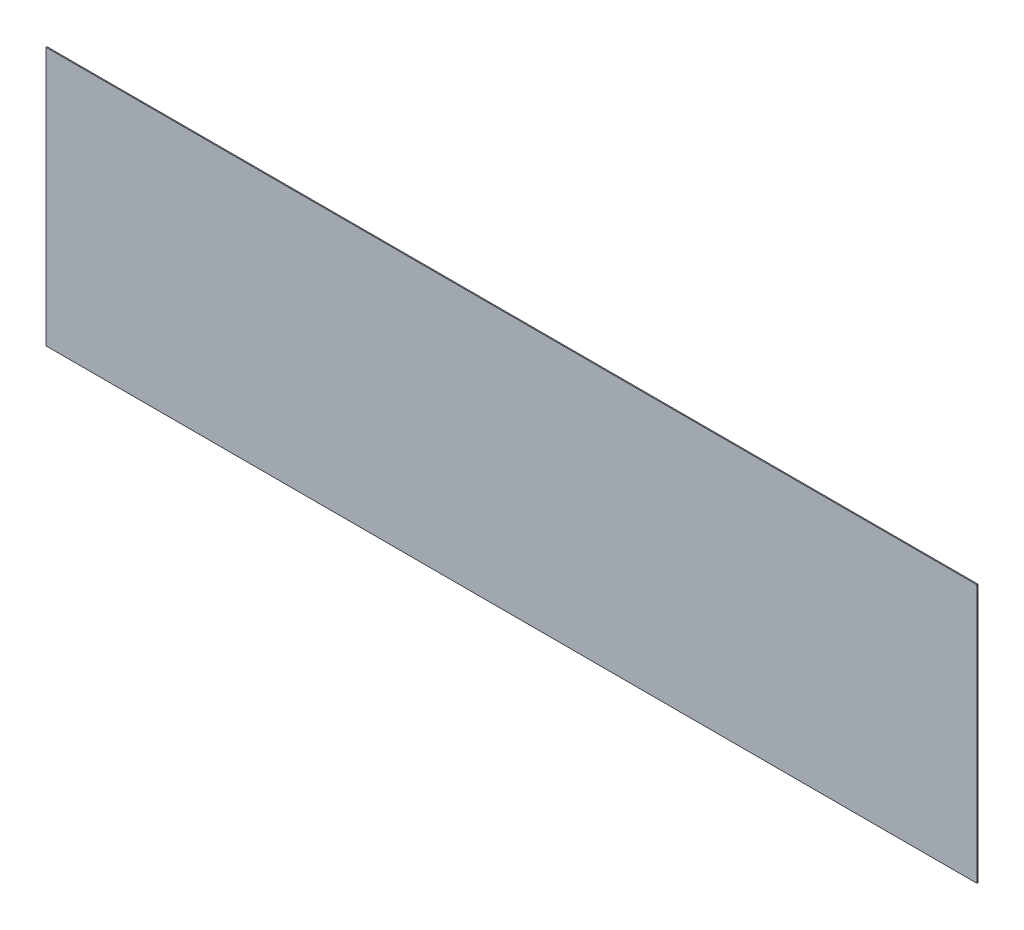
ISO-10303-21;
HEADER;
FILE_DESCRIPTION(('STEP AP214'),'2;1');
FILE_NAME('part.step','',(''),(''),'','','');
FILE_SCHEMA(('AUTOMOTIVE_DESIGN { 1 0 10303 214 1 1 1 1 }'));
ENDSEC;
DATA;
#1=APPLICATION_CONTEXT('core data for automotive mechanical design processes');
#2=APPLICATION_PROTOCOL_DEFINITION('international standard','automotive_design',2000,#1);
#3=PRODUCT_CONTEXT('',#1,'mechanical');
#4=PRODUCT('Part','Part','',(#3));
#5=PRODUCT_RELATED_PRODUCT_CATEGORY('part','',(#4));
#6=PRODUCT_DEFINITION_FORMATION('','',#4);
#7=PRODUCT_DEFINITION_CONTEXT('part definition',#1,'design');
#8=PRODUCT_DEFINITION('design','',#6,#7);
#9=PRODUCT_DEFINITION_SHAPE('','',#8);
#10=(LENGTH_UNIT() NAMED_UNIT(*) SI_UNIT(.MILLI.,.METRE.));
#11=(NAMED_UNIT(*) PLANE_ANGLE_UNIT() SI_UNIT($,.RADIAN.));
#12=(NAMED_UNIT(*) SI_UNIT($,.STERADIAN.) SOLID_ANGLE_UNIT());
#13=UNCERTAINTY_MEASURE_WITH_UNIT(LENGTH_MEASURE(1.E-05),#10,'distance_accuracy_value','');
#14=(GEOMETRIC_REPRESENTATION_CONTEXT(3) GLOBAL_UNCERTAINTY_ASSIGNED_CONTEXT((#13)) GLOBAL_UNIT_ASSIGNED_CONTEXT((#10,
#11,#12)) REPRESENTATION_CONTEXT('',''));
#15=CARTESIAN_POINT('',(0.,0.,0.));
#16=DIRECTION('',(0.,0.,1.));
#17=DIRECTION('',(1.,0.,0.));
#18=AXIS2_PLACEMENT_3D('',#15,#16,#17);
#19=CARTESIAN_POINT('',(900.,-250.,-2.));
#20=DIRECTION('',(1.,0.,0.));
#21=DIRECTION('',(0.,1.,0.));
#22=AXIS2_PLACEMENT_3D('',#19,#20,#21);
#23=PLANE('',#22);
#24=DIRECTION('',(0.,1.,0.));
#25=VECTOR('',#24,1.);
#26=CARTESIAN_POINT('',(900.,-250.,0.));
#27=LINE('',#26,#25);
#28=CARTESIAN_POINT('',(900.,-250.,0.));
#29=VERTEX_POINT('',#28);
#30=CARTESIAN_POINT('',(900.,250.,0.));
#31=VERTEX_POINT('',#30);
#32=EDGE_CURVE('E102',#29,#31,#27,.T.);
#33=ORIENTED_EDGE('',*,*,#32,.F.);
#34=DIRECTION('',(0.,0.,1.));
#35=VECTOR('',#34,1.);
#36=CARTESIAN_POINT('',(900.,-250.,-2.));
#37=LINE('',#36,#35);
#38=CARTESIAN_POINT('',(900.,-250.,-2.));
#39=VERTEX_POINT('',#38);
#40=EDGE_CURVE('E11',#39,#29,#37,.T.);
#41=ORIENTED_EDGE('',*,*,#40,.F.);
#42=DIRECTION('',(0.,1.,0.));
#43=VECTOR('',#42,1.);
#44=CARTESIAN_POINT('',(900.,-250.,-2.));
#45=LINE('',#44,#43);
#46=CARTESIAN_POINT('',(900.,250.,-2.));
#47=VERTEX_POINT('',#46);
#48=EDGE_CURVE('E96',#39,#47,#45,.T.);
#49=ORIENTED_EDGE('',*,*,#48,.T.);
#50=DIRECTION('',(0.,0.,1.));
#51=VECTOR('',#50,1.);
#52=CARTESIAN_POINT('',(900.,250.,-2.));
#53=LINE('',#52,#51);
#54=EDGE_CURVE('E41',#47,#31,#53,.T.);
#55=ORIENTED_EDGE('',*,*,#54,.T.);
#56=EDGE_LOOP('',(#33,#41,#49,#55));
#57=FACE_BOUND('',#56,.T.);
#58=ADVANCED_FACE('F38',(#57),#23,.T.);
#59=CARTESIAN_POINT('',(-900.,-250.,-2.));
#60=DIRECTION('',(0.,-1.,0.));
#61=DIRECTION('',(0.,0.,-1.));
#62=AXIS2_PLACEMENT_3D('',#59,#60,#61);
#63=PLANE('',#62);
#64=DIRECTION('',(1.,0.,0.));
#65=VECTOR('',#64,1.);
#66=CARTESIAN_POINT('',(-900.,-250.,0.));
#67=LINE('',#66,#65);
#68=CARTESIAN_POINT('',(-900.,-250.,0.));
#69=VERTEX_POINT('',#68);
#70=EDGE_CURVE('E98',#69,#29,#67,.T.);
#71=ORIENTED_EDGE('',*,*,#70,.F.);
#72=DIRECTION('',(0.,0.,1.));
#73=VECTOR('',#72,1.);
#74=CARTESIAN_POINT('',(-900.,-250.,-2.));
#75=LINE('',#74,#73);
#76=CARTESIAN_POINT('',(-900.,-250.,-2.));
#77=VERTEX_POINT('',#76);
#78=EDGE_CURVE('E47',#77,#69,#75,.T.);
#79=ORIENTED_EDGE('',*,*,#78,.F.);
#80=DIRECTION('',(1.,0.,0.));
#81=VECTOR('',#80,1.);
#82=CARTESIAN_POINT('',(-900.,-250.,-2.));
#83=LINE('',#82,#81);
#84=EDGE_CURVE('E93',#77,#39,#83,.T.);
#85=ORIENTED_EDGE('',*,*,#84,.T.);
#86=ORIENTED_EDGE('',*,*,#40,.T.);
#87=EDGE_LOOP('',(#71,#79,#85,#86));
#88=FACE_BOUND('',#87,.T.);
#89=ADVANCED_FACE('F112',(#88),#63,.T.);
#90=CARTESIAN_POINT('',(-900.,-250.,-2.));
#91=DIRECTION('',(-1.,0.,0.));
#92=DIRECTION('',(0.,-1.,0.));
#93=AXIS2_PLACEMENT_3D('',#90,#91,#92);
#94=PLANE('',#93);
#95=DIRECTION('',(0.,-1.,0.));
#96=VECTOR('',#95,1.);
#97=CARTESIAN_POINT('',(-900.,-250.,0.));
#98=LINE('',#97,#96);
#99=CARTESIAN_POINT('',(-900.,250.,0.));
#100=VERTEX_POINT('',#99);
#101=EDGE_CURVE('E88',#100,#69,#98,.T.);
#102=ORIENTED_EDGE('',*,*,#101,.F.);
#103=DIRECTION('',(0.,0.,1.));
#104=VECTOR('',#103,1.);
#105=CARTESIAN_POINT('',(-900.,250.,-2.));
#106=LINE('',#105,#104);
#107=CARTESIAN_POINT('',(-900.,250.,-2.));
#108=VERTEX_POINT('',#107);
#109=EDGE_CURVE('E83',#108,#100,#106,.T.);
#110=ORIENTED_EDGE('',*,*,#109,.F.);
#111=DIRECTION('',(0.,-1.,0.));
#112=VECTOR('',#111,1.);
#113=CARTESIAN_POINT('',(-900.,-250.,-2.));
#114=LINE('',#113,#112);
#115=EDGE_CURVE('E86',#108,#77,#114,.T.);
#116=ORIENTED_EDGE('',*,*,#115,.T.);
#117=ORIENTED_EDGE('',*,*,#78,.T.);
#118=EDGE_LOOP('',(#102,#110,#116,#117));
#119=FACE_BOUND('',#118,.T.);
#120=ADVANCED_FACE('F85',(#119),#94,.T.);
#121=CARTESIAN_POINT('',(-900.,250.,-2.));
#122=DIRECTION('',(0.,1.,0.));
#123=DIRECTION('',(0.,0.,1.));
#124=AXIS2_PLACEMENT_3D('',#121,#122,#123);
#125=PLANE('',#124);
#126=DIRECTION('',(-1.,0.,0.));
#127=VECTOR('',#126,1.);
#128=CARTESIAN_POINT('',(-900.,250.,0.));
#129=LINE('',#128,#127);
#130=EDGE_CURVE('E105',#31,#100,#129,.T.);
#131=ORIENTED_EDGE('',*,*,#130,.F.);
#132=ORIENTED_EDGE('',*,*,#54,.F.);
#133=DIRECTION('',(-1.,0.,0.));
#134=VECTOR('',#133,1.);
#135=CARTESIAN_POINT('',(-900.,250.,-2.));
#136=LINE('',#135,#134);
#137=EDGE_CURVE('E92',#47,#108,#136,.T.);
#138=ORIENTED_EDGE('',*,*,#137,.T.);
#139=ORIENTED_EDGE('',*,*,#109,.T.);
#140=EDGE_LOOP('',(#131,#132,#138,#139));
#141=FACE_BOUND('',#140,.T.);
#142=ADVANCED_FACE('F95',(#141),#125,.T.);
#143=CARTESIAN_POINT('',(0.,0.,-2.));
#144=DIRECTION('',(0.,0.,-1.));
#145=DIRECTION('',(-1.,0.,0.));
#146=AXIS2_PLACEMENT_3D('',#143,#144,#145);
#147=PLANE('',#146);
#148=ORIENTED_EDGE('',*,*,#48,.F.);
#149=ORIENTED_EDGE('',*,*,#84,.F.);
#150=ORIENTED_EDGE('',*,*,#115,.F.);
#151=ORIENTED_EDGE('',*,*,#137,.F.);
#152=EDGE_LOOP('',(#148,#149,#150,#151));
#153=FACE_BOUND('',#152,.T.);
#154=ADVANCED_FACE('F91',(#153),#147,.T.);
#155=CARTESIAN_POINT('',(0.,0.,0.));
#156=DIRECTION('',(0.,0.,-1.));
#157=DIRECTION('',(-1.,0.,0.));
#158=AXIS2_PLACEMENT_3D('',#155,#156,#157);
#159=PLANE('',#158);
#160=ORIENTED_EDGE('',*,*,#32,.T.);
#161=ORIENTED_EDGE('',*,*,#130,.T.);
#162=ORIENTED_EDGE('',*,*,#101,.T.);
#163=ORIENTED_EDGE('',*,*,#70,.T.);
#164=EDGE_LOOP('',(#160,#161,#162,#163));
#165=FACE_BOUND('',#164,.T.);
#166=ADVANCED_FACE('F111',(#165),#159,.F.);
#167=CLOSED_SHELL('',(#58,#89,#120,#142,#154,#166));
#168=MANIFOLD_SOLID_BREP('B2',#167);
#169=ADVANCED_BREP_SHAPE_REPRESENTATION('',(#18,#168),#14);
#170=SHAPE_DEFINITION_REPRESENTATION(#9,#169);
ENDSEC;
END-ISO-10303-21;
